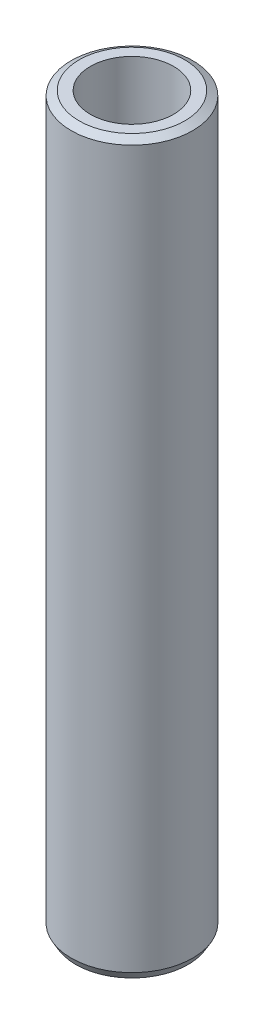
ISO-10303-21;
HEADER;
FILE_DESCRIPTION(('STEP AP214'),'2;1');
FILE_NAME('part.step','',(''),(''),'','','');
FILE_SCHEMA(('AUTOMOTIVE_DESIGN { 1 0 10303 214 1 1 1 1 }'));
ENDSEC;
DATA;
#1=APPLICATION_CONTEXT('core data for automotive mechanical design processes');
#2=APPLICATION_PROTOCOL_DEFINITION('international standard','automotive_design',2000,#1);
#3=PRODUCT_CONTEXT('',#1,'mechanical');
#4=PRODUCT('Part','Part','',(#3));
#5=PRODUCT_RELATED_PRODUCT_CATEGORY('part','',(#4));
#6=PRODUCT_DEFINITION_FORMATION('','',#4);
#7=PRODUCT_DEFINITION_CONTEXT('part definition',#1,'design');
#8=PRODUCT_DEFINITION('design','',#6,#7);
#9=PRODUCT_DEFINITION_SHAPE('','',#8);
#10=(LENGTH_UNIT() NAMED_UNIT(*) SI_UNIT(.MILLI.,.METRE.));
#11=(NAMED_UNIT(*) PLANE_ANGLE_UNIT() SI_UNIT($,.RADIAN.));
#12=(NAMED_UNIT(*) SI_UNIT($,.STERADIAN.) SOLID_ANGLE_UNIT());
#13=UNCERTAINTY_MEASURE_WITH_UNIT(LENGTH_MEASURE(1.E-05),#10,'distance_accuracy_value','');
#14=(GEOMETRIC_REPRESENTATION_CONTEXT(3) GLOBAL_UNCERTAINTY_ASSIGNED_CONTEXT((#13)) GLOBAL_UNIT_ASSIGNED_CONTEXT((#10,
#11,#12)) REPRESENTATION_CONTEXT('',''));
#15=CARTESIAN_POINT('',(0.,0.,0.));
#16=DIRECTION('',(0.,0.,1.));
#17=DIRECTION('',(1.,0.,0.));
#18=AXIS2_PLACEMENT_3D('',#15,#16,#17);
#19=CARTESIAN_POINT('',(0.,600.,0.));
#20=DIRECTION('',(0.,-1.,0.));
#21=DIRECTION('',(0.,0.,-1.));
#22=AXIS2_PLACEMENT_3D('',#19,#20,#21);
#23=CYLINDRICAL_SURFACE('',#22,50.);
#24=CARTESIAN_POINT('',(0.,596.260481544807,0.));
#25=DIRECTION('',(0.,1.,0.));
#26=DIRECTION('',(0.,0.,1.));
#27=AXIS2_PLACEMENT_3D('',#24,#25,#26);
#28=CIRCLE('',#27,50.);
#29=CARTESIAN_POINT('',(0.,596.260481544807,50.));
#30=VERTEX_POINT('',#29);
#31=EDGE_CURVE('E50',#30,#30,#28,.F.);
#32=ORIENTED_EDGE('',*,*,#31,.T.);
#33=EDGE_LOOP('',(#32));
#34=FACE_BOUND('',#33,.T.);
#35=CARTESIAN_POINT('',(0.,6.4770359602353,0.));
#36=DIRECTION('',(0.,1.,0.));
#37=DIRECTION('',(0.,0.,1.));
#38=AXIS2_PLACEMENT_3D('',#35,#36,#37);
#39=CIRCLE('',#38,50.);
#40=CARTESIAN_POINT('',(0.,6.4770359602353,50.));
#41=VERTEX_POINT('',#40);
#42=EDGE_CURVE('E51',#41,#41,#39,.T.);
#43=ORIENTED_EDGE('',*,*,#42,.T.);
#44=EDGE_LOOP('',(#43));
#45=FACE_BOUND('',#44,.T.);
#46=ADVANCED_FACE('F39',(#34,#45),#23,.T.);
#47=CARTESIAN_POINT('',(0.,600.,0.));
#48=DIRECTION('',(0.,1.,0.));
#49=DIRECTION('',(0.,0.,1.));
#50=AXIS2_PLACEMENT_3D('',#47,#48,#49);
#51=PLANE('',#50);
#52=CARTESIAN_POINT('',(0.,600.,0.));
#53=DIRECTION('',(0.,1.,0.));
#54=DIRECTION('',(0.,0.,1.));
#55=AXIS2_PLACEMENT_3D('',#52,#53,#54);
#56=CIRCLE('',#55,43.5229640397642);
#57=CARTESIAN_POINT('',(0.,600.,43.5229640397642));
#58=VERTEX_POINT('',#57);
#59=EDGE_CURVE('E54',#58,#58,#56,.T.);
#60=ORIENTED_EDGE('',*,*,#59,.T.);
#61=EDGE_LOOP('',(#60));
#62=FACE_BOUND('',#61,.T.);
#63=CARTESIAN_POINT('',(0.,600.,0.));
#64=DIRECTION('',(0.,1.,0.));
#65=DIRECTION('',(0.,0.,1.));
#66=AXIS2_PLACEMENT_3D('',#63,#64,#65);
#67=CIRCLE('',#66,34.2470473088188);
#68=CARTESIAN_POINT('',(0.,600.,34.2470473088188));
#69=VERTEX_POINT('',#68);
#70=EDGE_CURVE('E58',#69,#69,#67,.T.);
#71=ORIENTED_EDGE('',*,*,#70,.F.);
#72=EDGE_LOOP('',(#71));
#73=FACE_BOUND('',#72,.T.);
#74=ADVANCED_FACE('F69',(#62,#73),#51,.T.);
#75=CARTESIAN_POINT('',(0.,0.,0.));
#76=DIRECTION('',(0.,1.,0.));
#77=DIRECTION('',(0.,0.,1.));
#78=AXIS2_PLACEMENT_3D('',#75,#76,#77);
#79=PLANE('',#78);
#80=CARTESIAN_POINT('',(0.,0.,0.));
#81=DIRECTION('',(0.,1.,0.));
#82=DIRECTION('',(0.,0.,1.));
#83=AXIS2_PLACEMENT_3D('',#80,#81,#82);
#84=CIRCLE('',#83,46.2604815448073);
#85=CARTESIAN_POINT('',(0.,0.,46.2604815448073));
#86=VERTEX_POINT('',#85);
#87=EDGE_CURVE('E10',#86,#86,#84,.F.);
#88=ORIENTED_EDGE('',*,*,#87,.T.);
#89=EDGE_LOOP('',(#88));
#90=FACE_BOUND('',#89,.T.);
#91=CARTESIAN_POINT('',(0.,0.,0.));
#92=DIRECTION('',(0.,1.,0.));
#93=DIRECTION('',(0.,0.,1.));
#94=AXIS2_PLACEMENT_3D('',#91,#92,#93);
#95=CIRCLE('',#94,34.2470473088188);
#96=CARTESIAN_POINT('',(0.,0.,34.2470473088188));
#97=VERTEX_POINT('',#96);
#98=EDGE_CURVE('E63',#97,#97,#95,.T.);
#99=ORIENTED_EDGE('',*,*,#98,.T.);
#100=EDGE_LOOP('',(#99));
#101=FACE_BOUND('',#100,.T.);
#102=ADVANCED_FACE('F75',(#90,#101),#79,.F.);
#103=CARTESIAN_POINT('',(0.,600.,0.));
#104=DIRECTION('',(0.,-1.,0.));
#105=DIRECTION('',(0.,0.,-1.));
#106=AXIS2_PLACEMENT_3D('',#103,#104,#105);
#107=CYLINDRICAL_SURFACE('',#106,34.2470473088188);
#108=ORIENTED_EDGE('',*,*,#70,.T.);
#109=EDGE_LOOP('',(#108));
#110=FACE_BOUND('',#109,.T.);
#111=ORIENTED_EDGE('',*,*,#98,.F.);
#112=EDGE_LOOP('',(#111));
#113=FACE_BOUND('',#112,.T.);
#114=ADVANCED_FACE('F70',(#110,#113),#107,.F.);
#115=CARTESIAN_POINT('',(0.,600.,0.));
#116=DIRECTION('',(0.,-1.,0.));
#117=DIRECTION('',(0.,0.,-1.));
#118=AXIS2_PLACEMENT_3D('',#115,#116,#117);
#119=CONICAL_SURFACE('',#118,43.5229640397642,1.0471975511966);
#120=ORIENTED_EDGE('',*,*,#31,.F.);
#121=EDGE_LOOP('',(#120));
#122=FACE_BOUND('',#121,.T.);
#123=ORIENTED_EDGE('',*,*,#59,.F.);
#124=EDGE_LOOP('',(#123));
#125=FACE_BOUND('',#124,.T.);
#126=ADVANCED_FACE('F81',(#122,#125),#119,.T.);
#127=CARTESIAN_POINT('',(0.,6.4770359602353,0.));
#128=DIRECTION('',(0.,1.,0.));
#129=DIRECTION('',(0.,0.,1.));
#130=AXIS2_PLACEMENT_3D('',#127,#128,#129);
#131=CONICAL_SURFACE('',#130,50.,0.523598775598298);
#132=CARTESIAN_POINT('',(0.,0.,46.2604815448073));
#133=CARTESIAN_POINT('',(0.,0.0674691245857835,46.2994348620489));
#134=CARTESIAN_POINT('',(0.,0.134938249171568,46.3383881792905));
#135=CARTESIAN_POINT('',(0.,0.269876498343137,46.4162948137736));
#136=CARTESIAN_POINT('',(0.,0.337345622928921,46.4552481310152));
#137=CARTESIAN_POINT('',(0.,0.47228387210049,46.5331547654984));
#138=CARTESIAN_POINT('',(0.,0.539752996686274,46.57210808274));
#139=CARTESIAN_POINT('',(0.,0.674691245857843,46.6500147172232));
#140=CARTESIAN_POINT('',(0.,0.742160370443627,46.6889680344648));
#141=CARTESIAN_POINT('',(0.,0.877098619615196,46.7668746689479));
#142=CARTESIAN_POINT('',(0.,0.94456774420098,46.8058279861895));
#143=CARTESIAN_POINT('',(0.,1.07950599337255,46.8837346206727));
#144=CARTESIAN_POINT('',(0.,1.14697511795833,46.9226879379143));
#145=CARTESIAN_POINT('',(0.,1.2819133671299,47.0005945723975));
#146=CARTESIAN_POINT('',(0.,1.34938249171569,47.0395478896391));
#147=CARTESIAN_POINT('',(0.,1.48432074088726,47.1174545241223));
#148=CARTESIAN_POINT('',(0.,1.55178986547304,47.1564078413639));
#149=CARTESIAN_POINT('',(0.,1.68672811464461,47.234314475847));
#150=CARTESIAN_POINT('',(0.,1.75419723923039,47.2732677930886));
#151=CARTESIAN_POINT('',(0.,1.88913548840196,47.3511744275718));
#152=CARTESIAN_POINT('',(0.,1.95660461298775,47.3901277448134));
#153=CARTESIAN_POINT('',(0.,2.09154286215932,47.4680343792966));
#154=CARTESIAN_POINT('',(0.,2.1590119867451,47.5069876965382));
#155=CARTESIAN_POINT('',(0.,2.29395023591667,47.5848943310214));
#156=CARTESIAN_POINT('',(0.,2.36141936050245,47.623847648263));
#157=CARTESIAN_POINT('',(0.,2.49635760967402,47.7017542827461));
#158=CARTESIAN_POINT('',(0.,2.56382673425981,47.7407075999877));
#159=CARTESIAN_POINT('',(0.,2.69876498343137,47.8186142344709));
#160=CARTESIAN_POINT('',(0.,2.76623410801716,47.8575675517125));
#161=CARTESIAN_POINT('',(0.,2.90117235718873,47.9354741861957));
#162=CARTESIAN_POINT('',(0.,2.96864148177451,47.9744275034373));
#163=CARTESIAN_POINT('',(0.,3.10357973094608,48.0523341379205));
#164=CARTESIAN_POINT('',(0.,3.17104885553186,48.0912874551621));
#165=CARTESIAN_POINT('',(0.,3.30598710470343,48.1691940896452));
#166=CARTESIAN_POINT('',(0.,3.37345622928922,48.2081474068868));
#167=CARTESIAN_POINT('',(0.,3.50839447846079,48.28605404137));
#168=CARTESIAN_POINT('',(0.,3.57586360304657,48.3250073586116));
#169=CARTESIAN_POINT('',(0.,3.71080185221814,48.4029139930948));
#170=CARTESIAN_POINT('',(0.,3.77827097680392,48.4418673103364));
#171=CARTESIAN_POINT('',(0.,3.91320922597549,48.5197739448195));
#172=CARTESIAN_POINT('',(0.,3.98067835056128,48.5587272620611));
#173=CARTESIAN_POINT('',(0.,4.11561659973285,48.6366338965443));
#174=CARTESIAN_POINT('',(0.,4.18308572431863,48.6755872137859));
#175=CARTESIAN_POINT('',(0.,4.3180239734902,48.7534938482691));
#176=CARTESIAN_POINT('',(0.,4.38549309807598,48.7924471655107));
#177=CARTESIAN_POINT('',(0.,4.52043134724755,48.8703537999939));
#178=CARTESIAN_POINT('',(0.,4.58790047183334,48.9093071172355));
#179=CARTESIAN_POINT('',(0.,4.7228387210049,48.9872137517186));
#180=CARTESIAN_POINT('',(0.,4.79030784559069,49.0261670689602));
#181=CARTESIAN_POINT('',(0.,4.92524609476226,49.1040737034434));
#182=CARTESIAN_POINT('',(0.,4.99271521934804,49.143027020685));
#183=CARTESIAN_POINT('',(0.,5.12765346851961,49.2209336551682));
#184=CARTESIAN_POINT('',(0.,5.1951225931054,49.2598869724098));
#185=CARTESIAN_POINT('',(0.,5.33006084227696,49.337793606893));
#186=CARTESIAN_POINT('',(0.,5.39752996686275,49.3767469241346));
#187=CARTESIAN_POINT('',(0.,5.53246821603432,49.4546535586177));
#188=CARTESIAN_POINT('',(0.,5.5999373406201,49.4936068758593));
#189=CARTESIAN_POINT('',(0.,5.73487558979167,49.5715135103425));
#190=CARTESIAN_POINT('',(0.,5.80234471437746,49.6104668275841));
#191=CARTESIAN_POINT('',(0.,5.93728296354902,49.6883734620673));
#192=CARTESIAN_POINT('',(0.,6.00475208813481,49.7273267793089));
#193=CARTESIAN_POINT('',(0.,6.13969033730638,49.805233413792));
#194=CARTESIAN_POINT('',(0.,6.20715946189216,49.8441867310336));
#195=CARTESIAN_POINT('',(0.,6.34209771106373,49.9220933655168));
#196=CARTESIAN_POINT('',(0.,6.40956683564951,49.9610466827584));
#197=CARTESIAN_POINT('',(0.,6.4770359602353,50.));
#198=B_SPLINE_CURVE_WITH_KNOTS('',3,(#132,#133,#134,#135,#136,#137,#138,#139,#140,#141,#142,
#143,#144,#145,#146,#147,#148,#149,#150,#151,#152,#153,#154,#155,#156,#157,#158,#159,#160,#161,
#162,#163,#164,#165,#166,#167,#168,#169,#170,#171,#172,#173,#174,#175,#176,#177,#178,#179,#180,
#181,#182,#183,#184,#185,#186,#187,#188,#189,#190,#191,#192,#193,#194,#195,#196,#197),
.UNSPECIFIED.,.F.,.F.,(4,2,2,2,2,2,2,2,2,2,2,2,2,2,2,2,2,2,2,2,2,2,2,2,2,2,2,2,2,2,2,2,4),(0.,
0.233719903449546,0.467439806899091,0.701159710348637,0.934879613798183,1.16859951724773,
1.40231942069727,1.63603932414682,1.86975922759637,2.10347913104591,2.33719903449546,
2.57091893794501,2.80463884139455,3.0383587448441,3.27207864829364,3.50579855174319,
3.73951845519273,3.97323835864228,4.20695826209182,4.44067816554137,4.67439806899092,
4.90811797244046,5.14183787589001,5.37555777933955,5.6092776827891,5.84299758623864,
6.07671748968819,6.31043739313774,6.54415729658728,6.77787720003683,7.01159710348637,
7.24531700693592,7.47903691038546),.UNSPECIFIED.);
#199=EDGE_CURVE('BSEAM45',#86,#41,#198,.T.);
#200=ORIENTED_EDGE('',*,*,#87,.F.);
#201=ORIENTED_EDGE('',*,*,#42,.F.);
#202=ORIENTED_EDGE('',*,*,#199,.T.);
#203=ORIENTED_EDGE('',*,*,#199,.F.);
#204=EDGE_LOOP('',(#200,#202,#201,#203));
#205=FACE_BOUND('',#204,.T.);
#206=ADVANCED_FACE('F45',(#205),#131,.T.);
#207=CLOSED_SHELL('',(#46,#74,#102,#114,#126,#206));
#208=MANIFOLD_SOLID_BREP('B2',#207);
#209=ADVANCED_BREP_SHAPE_REPRESENTATION('',(#18,#208),#14);
#210=SHAPE_DEFINITION_REPRESENTATION(#9,#209);
ENDSEC;
END-ISO-10303-21;
